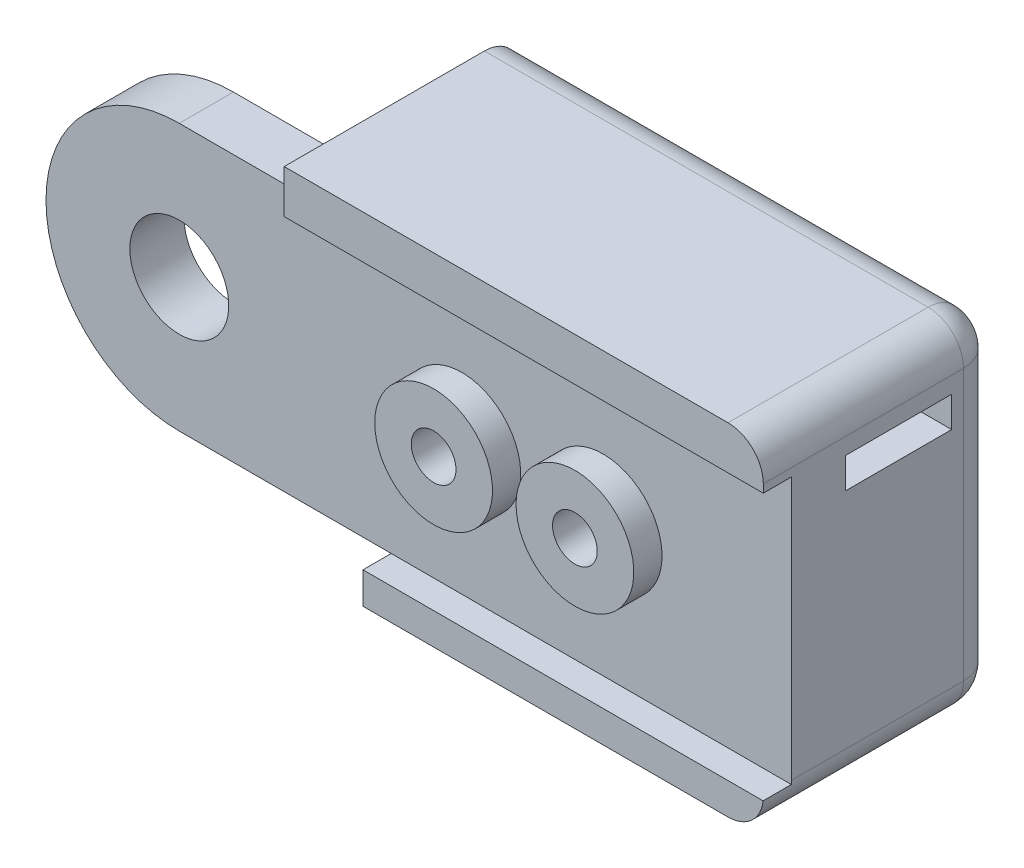
ISO-10303-21;
HEADER;
FILE_DESCRIPTION(('STEP AP214'),'2;1');
FILE_NAME('part.step','',(''),(''),'','','');
FILE_SCHEMA(('AUTOMOTIVE_DESIGN { 1 0 10303 214 1 1 1 1 }'));
ENDSEC;
DATA;
#1=APPLICATION_CONTEXT('core data for automotive mechanical design processes');
#2=APPLICATION_PROTOCOL_DEFINITION('international standard','automotive_design',2000,#1);
#3=PRODUCT_CONTEXT('',#1,'mechanical');
#4=PRODUCT('Part','Part','',(#3));
#5=PRODUCT_RELATED_PRODUCT_CATEGORY('part','',(#4));
#6=PRODUCT_DEFINITION_FORMATION('','',#4);
#7=PRODUCT_DEFINITION_CONTEXT('part definition',#1,'design');
#8=PRODUCT_DEFINITION('design','',#6,#7);
#9=PRODUCT_DEFINITION_SHAPE('','',#8);
#10=(LENGTH_UNIT() NAMED_UNIT(*) SI_UNIT(.MILLI.,.METRE.));
#11=(NAMED_UNIT(*) PLANE_ANGLE_UNIT() SI_UNIT($,.RADIAN.));
#12=(NAMED_UNIT(*) SI_UNIT($,.STERADIAN.) SOLID_ANGLE_UNIT());
#13=UNCERTAINTY_MEASURE_WITH_UNIT(LENGTH_MEASURE(1.E-05),#10,'distance_accuracy_value','');
#14=(GEOMETRIC_REPRESENTATION_CONTEXT(3) GLOBAL_UNCERTAINTY_ASSIGNED_CONTEXT((#13)) GLOBAL_UNIT_ASSIGNED_CONTEXT((#10,
#11,#12)) REPRESENTATION_CONTEXT('',''));
#15=CARTESIAN_POINT('',(0.,0.,0.));
#16=DIRECTION('',(0.,0.,1.));
#17=DIRECTION('',(1.,0.,0.));
#18=AXIS2_PLACEMENT_3D('',#15,#16,#17);
#19=CARTESIAN_POINT('',(0.,0.,-8.));
#20=DIRECTION('',(0.,0.,-1.));
#21=DIRECTION('',(-1.,0.,0.));
#22=AXIS2_PLACEMENT_3D('',#19,#20,#21);
#23=PLANE('',#22);
#24=CARTESIAN_POINT('',(12.,0.,-8.));
#25=DIRECTION('',(0.,0.,-1.));
#26=DIRECTION('',(-1.,0.,0.));
#27=AXIS2_PLACEMENT_3D('',#24,#25,#26);
#28=CIRCLE('',#27,2.5);
#29=CARTESIAN_POINT('',(9.50000000000001,0.,-8.));
#30=VERTEX_POINT('',#29);
#31=EDGE_CURVE('E442',#30,#30,#28,.T.);
#32=ORIENTED_EDGE('',*,*,#31,.F.);
#33=EDGE_LOOP('',(#32));
#34=FACE_BOUND('',#33,.T.);
#35=CARTESIAN_POINT('',(12.,0.,-8.));
#36=DIRECTION('',(0.,0.,-1.));
#37=DIRECTION('',(-1.,0.,0.));
#38=AXIS2_PLACEMENT_3D('',#35,#36,#37);
#39=CIRCLE('',#38,0.949999999999999);
#40=CARTESIAN_POINT('',(11.05,0.,-8.));
#41=VERTEX_POINT('',#40);
#42=EDGE_CURVE('E454',#41,#41,#39,.F.);
#43=ORIENTED_EDGE('',*,*,#42,.F.);
#44=EDGE_LOOP('',(#43));
#45=FACE_BOUND('',#44,.T.);
#46=ADVANCED_FACE('F42',(#34,#45),#23,.F.);
#47=CARTESIAN_POINT('',(18.,0.,-8.));
#48=DIRECTION('',(0.,0.,-1.));
#49=DIRECTION('',(-1.,0.,0.));
#50=AXIS2_PLACEMENT_3D('',#47,#48,#49);
#51=CIRCLE('',#50,2.5);
#52=CARTESIAN_POINT('',(15.5,0.,-8.));
#53=VERTEX_POINT('',#52);
#54=EDGE_CURVE('E439',#53,#53,#51,.T.);
#55=ORIENTED_EDGE('',*,*,#54,.F.);
#56=EDGE_LOOP('',(#55));
#57=FACE_BOUND('',#56,.T.);
#58=CARTESIAN_POINT('',(18.,0.,-8.));
#59=DIRECTION('',(0.,0.,-1.));
#60=DIRECTION('',(-1.,0.,0.));
#61=AXIS2_PLACEMENT_3D('',#58,#59,#60);
#62=CIRCLE('',#61,0.950000000000001);
#63=CARTESIAN_POINT('',(17.05,0.,-8.));
#64=VERTEX_POINT('',#63);
#65=EDGE_CURVE('E46',#64,#64,#62,.F.);
#66=ORIENTED_EDGE('',*,*,#65,.F.);
#67=EDGE_LOOP('',(#66));
#68=FACE_BOUND('',#67,.T.);
#69=ADVANCED_FACE('F44',(#57,#68),#23,.F.);
#70=DIRECTION('',(-1.,0.,0.));
#71=VECTOR('',#70,1.);
#72=CARTESIAN_POINT('',(26.,-7.00163526528755,-8.));
#73=LINE('',#72,#71);
#74=CARTESIAN_POINT('',(24.5,-7.00163526528755,-8.));
#75=VERTEX_POINT('',#74);
#76=CARTESIAN_POINT('',(9.00000000000001,-7.00163526528755,-8.));
#77=VERTEX_POINT('',#76);
#78=EDGE_CURVE('E435',#75,#77,#73,.T.);
#79=ORIENTED_EDGE('',*,*,#78,.F.);
#80=CARTESIAN_POINT('',(24.5,-5.50163526528755,-8.));
#81=DIRECTION('',(0.,0.,-1.));
#82=DIRECTION('',(-1.,0.,0.));
#83=AXIS2_PLACEMENT_3D('',#80,#81,#82);
#84=CIRCLE('',#83,1.5);
#85=CARTESIAN_POINT('',(25.9916169632113,-5.65999825042065,-8.));
#86=VERTEX_POINT('',#85);
#87=EDGE_CURVE('E52',#75,#86,#84,.F.);
#88=ORIENTED_EDGE('',*,*,#87,.T.);
#89=DIRECTION('',(1.,0.,0.));
#90=VECTOR('',#89,1.);
#91=CARTESIAN_POINT('',(9.00000000000001,-5.65999825042065,-8.));
#92=LINE('',#91,#90);
#93=CARTESIAN_POINT('',(9.00000000000001,-5.65999825042065,-8.));
#94=VERTEX_POINT('',#93);
#95=EDGE_CURVE('E428',#94,#86,#92,.T.);
#96=ORIENTED_EDGE('',*,*,#95,.F.);
#97=DIRECTION('',(0.,1.,0.));
#98=VECTOR('',#97,1.);
#99=CARTESIAN_POINT('',(9.00000000000001,-7.00163526528755,-8.));
#100=LINE('',#99,#98);
#101=EDGE_CURVE('E451',#77,#94,#100,.T.);
#102=ORIENTED_EDGE('',*,*,#101,.F.);
#103=EDGE_LOOP('',(#79,#88,#96,#102));
#104=FACE_BOUND('',#103,.T.);
#105=ADVANCED_FACE('F472',(#104),#23,.F.);
#106=DIRECTION('',(-1.,0.,0.));
#107=VECTOR('',#106,1.);
#108=CARTESIAN_POINT('',(26.,5.65685424949239,-8.));
#109=LINE('',#108,#107);
#110=CARTESIAN_POINT('',(26.,5.65685424949239,-8.));
#111=VERTEX_POINT('',#110);
#112=CARTESIAN_POINT('',(5.65685424949238,5.65685424949239,-8.));
#113=VERTEX_POINT('',#112);
#114=EDGE_CURVE('E436',#111,#113,#109,.T.);
#115=ORIENTED_EDGE('',*,*,#114,.F.);
#116=DIRECTION('',(0.,-1.,0.));
#117=VECTOR('',#116,1.);
#118=CARTESIAN_POINT('',(26.,-7.00163526528755,-8.));
#119=LINE('',#118,#117);
#120=CARTESIAN_POINT('',(26.,5.99836473471239,-8.));
#121=VERTEX_POINT('',#120);
#122=EDGE_CURVE('E198',#121,#111,#119,.T.);
#123=ORIENTED_EDGE('',*,*,#122,.F.);
#124=CARTESIAN_POINT('',(24.5,5.99836473471239,-8.));
#125=DIRECTION('',(0.,0.,-1.));
#126=DIRECTION('',(-1.,0.,0.));
#127=AXIS2_PLACEMENT_3D('',#124,#125,#126);
#128=CIRCLE('',#127,1.5);
#129=CARTESIAN_POINT('',(24.5,7.49836473471239,-8.));
#130=VERTEX_POINT('',#129);
#131=EDGE_CURVE('E12',#121,#130,#128,.F.);
#132=ORIENTED_EDGE('',*,*,#131,.T.);
#133=DIRECTION('',(1.,0.,0.));
#134=VECTOR('',#133,1.);
#135=CARTESIAN_POINT('',(5.65685424949238,7.49836473471238,-8.));
#136=LINE('',#135,#134);
#137=CARTESIAN_POINT('',(5.65685424949238,7.49836473471238,-8.));
#138=VERTEX_POINT('',#137);
#139=EDGE_CURVE('E66',#138,#130,#136,.T.);
#140=ORIENTED_EDGE('',*,*,#139,.F.);
#141=DIRECTION('',(0.,1.,0.));
#142=VECTOR('',#141,1.);
#143=CARTESIAN_POINT('',(5.65685424949238,5.65685424949239,-8.));
#144=LINE('',#143,#142);
#145=EDGE_CURVE('E432',#113,#138,#144,.T.);
#146=ORIENTED_EDGE('',*,*,#145,.F.);
#147=EDGE_LOOP('',(#115,#123,#132,#140,#146));
#148=FACE_BOUND('',#147,.T.);
#149=ADVANCED_FACE('F474',(#148),#23,.F.);
#150=CARTESIAN_POINT('',(18.,0.,1.2));
#151=DIRECTION('',(0.,0.,-1.));
#152=DIRECTION('',(-1.,0.,0.));
#153=AXIS2_PLACEMENT_3D('',#150,#151,#152);
#154=CYLINDRICAL_SURFACE('',#153,0.950000000000001);
#155=ORIENTED_EDGE('',*,*,#65,.T.);
#156=EDGE_LOOP('',(#155));
#157=FACE_BOUND('',#156,.T.);
#158=CARTESIAN_POINT('',(18.,0.,-13.5));
#159=DIRECTION('',(0.,0.,1.));
#160=DIRECTION('',(1.,0.,0.));
#161=AXIS2_PLACEMENT_3D('',#158,#159,#160);
#162=CIRCLE('',#161,0.950000000000001);
#163=CARTESIAN_POINT('',(18.95,0.,-13.5));
#164=VERTEX_POINT('',#163);
#165=EDGE_CURVE('E341',#164,#164,#162,.F.);
#166=ORIENTED_EDGE('',*,*,#165,.T.);
#167=EDGE_LOOP('',(#166));
#168=FACE_BOUND('',#167,.T.);
#169=ADVANCED_FACE('F468',(#157,#168),#154,.F.);
#170=CARTESIAN_POINT('',(12.,0.,1.2));
#171=DIRECTION('',(0.,0.,-1.));
#172=DIRECTION('',(-1.,0.,0.));
#173=AXIS2_PLACEMENT_3D('',#170,#171,#172);
#174=CYLINDRICAL_SURFACE('',#173,0.949999999999999);
#175=ORIENTED_EDGE('',*,*,#42,.T.);
#176=EDGE_LOOP('',(#175));
#177=FACE_BOUND('',#176,.T.);
#178=CARTESIAN_POINT('',(12.,0.,-13.5));
#179=DIRECTION('',(0.,0.,1.));
#180=DIRECTION('',(1.,0.,0.));
#181=AXIS2_PLACEMENT_3D('',#178,#179,#180);
#182=CIRCLE('',#181,0.949999999999999);
#183=CARTESIAN_POINT('',(12.95,0.,-13.5));
#184=VERTEX_POINT('',#183);
#185=EDGE_CURVE('E337',#184,#184,#182,.F.);
#186=ORIENTED_EDGE('',*,*,#185,.T.);
#187=EDGE_LOOP('',(#186));
#188=FACE_BOUND('',#187,.T.);
#189=ADVANCED_FACE('F488',(#177,#188),#174,.F.);
#190=CARTESIAN_POINT('',(9.00000000000001,-7.00163526528755,2.));
#191=DIRECTION('',(1.,0.,0.));
#192=DIRECTION('',(0.,0.,-1.));
#193=AXIS2_PLACEMENT_3D('',#190,#191,#192);
#194=PLANE('',#193);
#195=DIRECTION('',(0.,0.,-1.));
#196=VECTOR('',#195,1.);
#197=CARTESIAN_POINT('',(9.00000000000001,-7.00163526528755,2.));
#198=LINE('',#197,#196);
#199=CARTESIAN_POINT('',(9.00000000000001,-7.00163526528755,-16.5));
#200=VERTEX_POINT('',#199);
#201=EDGE_CURVE('E413',#77,#200,#198,.T.);
#202=ORIENTED_EDGE('',*,*,#201,.F.);
#203=ORIENTED_EDGE('',*,*,#101,.T.);
#204=DIRECTION('',(0.,0.,1.));
#205=VECTOR('',#204,1.);
#206=CARTESIAN_POINT('',(9.00000000000001,-5.65999825042065,-8.));
#207=LINE('',#206,#205);
#208=CARTESIAN_POINT('',(9.00000000000001,-5.65999825042065,-9.2));
#209=VERTEX_POINT('',#208);
#210=EDGE_CURVE('E204',#209,#94,#207,.T.);
#211=ORIENTED_EDGE('',*,*,#210,.F.);
#212=DIRECTION('',(0.,0.,-1.));
#213=VECTOR('',#212,1.);
#214=CARTESIAN_POINT('',(9.00000000000001,-5.65999825042065,-9.2));
#215=LINE('',#214,#213);
#216=CARTESIAN_POINT('',(9.00000000000001,-5.65999825042065,-11.5));
#217=VERTEX_POINT('',#216);
#218=EDGE_CURVE('E223',#209,#217,#215,.T.);
#219=ORIENTED_EDGE('',*,*,#218,.T.);
#220=DIRECTION('',(0.,1.,0.));
#221=VECTOR('',#220,1.);
#222=CARTESIAN_POINT('',(9.00000000000001,-7.00163526528755,-11.5));
#223=LINE('',#222,#221);
#224=CARTESIAN_POINT('',(9.00000000000001,-2.50163526528762,-11.5));
#225=VERTEX_POINT('',#224);
#226=EDGE_CURVE('E262',#217,#225,#223,.T.);
#227=ORIENTED_EDGE('',*,*,#226,.T.);
#228=DIRECTION('',(0.,0.,1.));
#229=VECTOR('',#228,1.);
#230=CARTESIAN_POINT('',(9.00000000000001,-2.50163526528762,-18.));
#231=LINE('',#230,#229);
#232=CARTESIAN_POINT('',(9.00000000000001,-2.50163526528762,-18.));
#233=VERTEX_POINT('',#232);
#234=EDGE_CURVE('E318',#233,#225,#231,.T.);
#235=ORIENTED_EDGE('',*,*,#234,.F.);
#236=DIRECTION('',(0.,-1.,0.));
#237=VECTOR('',#236,1.);
#238=CARTESIAN_POINT('',(9.00000000000001,-7.00163526528755,-18.));
#239=LINE('',#238,#237);
#240=CARTESIAN_POINT('',(9.00000000000001,-5.50163526528755,-18.));
#241=VERTEX_POINT('',#240);
#242=EDGE_CURVE('E307',#233,#241,#239,.T.);
#243=ORIENTED_EDGE('',*,*,#242,.T.);
#244=CARTESIAN_POINT('',(9.00000000000001,-5.50163526528755,-16.5));
#245=DIRECTION('',(-1.,0.,0.));
#246=DIRECTION('',(0.,0.,1.));
#247=AXIS2_PLACEMENT_3D('',#244,#245,#246);
#248=CIRCLE('',#247,1.5);
#249=EDGE_CURVE('E370',#200,#241,#248,.F.);
#250=ORIENTED_EDGE('',*,*,#249,.F.);
#251=EDGE_LOOP('',(#202,#203,#211,#219,#227,#235,#243,#250));
#252=FACE_BOUND('',#251,.T.);
#253=ADVANCED_FACE('F603',(#252),#194,.F.);
#254=CARTESIAN_POINT('',(26.,-7.00163526528755,2.));
#255=DIRECTION('',(0.,1.,0.));
#256=DIRECTION('',(-1.,0.,0.));
#257=AXIS2_PLACEMENT_3D('',#254,#255,#256);
#258=PLANE('',#257);
#259=DIRECTION('',(0.,0.,-1.));
#260=VECTOR('',#259,1.);
#261=CARTESIAN_POINT('',(24.5,-7.00163526528755,2.));
#262=LINE('',#261,#260);
#263=CARTESIAN_POINT('',(24.5,-7.00163526528755,-16.5));
#264=VERTEX_POINT('',#263);
#265=EDGE_CURVE('E422',#264,#75,#262,.F.);
#266=ORIENTED_EDGE('',*,*,#265,.T.);
#267=ORIENTED_EDGE('',*,*,#78,.T.);
#268=ORIENTED_EDGE('',*,*,#201,.T.);
#269=DIRECTION('',(1.,0.,0.));
#270=VECTOR('',#269,1.);
#271=CARTESIAN_POINT('',(9.00000000000001,-7.00163526528755,-16.5));
#272=LINE('',#271,#270);
#273=EDGE_CURVE('E366',#264,#200,#272,.F.);
#274=ORIENTED_EDGE('',*,*,#273,.F.);
#275=EDGE_LOOP('',(#266,#267,#268,#274));
#276=FACE_BOUND('',#275,.T.);
#277=CARTESIAN_POINT('',(22.,-7.00163526528755,-15.));
#278=DIRECTION('',(0.,1.,0.));
#279=DIRECTION('',(1.,0.,0.));
#280=AXIS2_PLACEMENT_3D('',#277,#278,#279);
#281=CIRCLE('',#280,0.950000000000001);
#282=CARTESIAN_POINT('',(22.95,-7.00163526528755,-15.));
#283=VERTEX_POINT('',#282);
#284=EDGE_CURVE('E703',#283,#283,#281,.T.);
#285=ORIENTED_EDGE('',*,*,#284,.T.);
#286=EDGE_LOOP('',(#285));
#287=FACE_BOUND('',#286,.T.);
#288=CARTESIAN_POINT('',(18.,-7.00163526528755,-15.));
#289=DIRECTION('',(0.,1.,0.));
#290=DIRECTION('',(1.,0.,0.));
#291=AXIS2_PLACEMENT_3D('',#288,#289,#290);
#292=CIRCLE('',#291,0.950000000000001);
#293=CARTESIAN_POINT('',(18.95,-7.00163526528755,-15.));
#294=VERTEX_POINT('',#293);
#295=EDGE_CURVE('E695',#294,#294,#292,.T.);
#296=ORIENTED_EDGE('',*,*,#295,.T.);
#297=EDGE_LOOP('',(#296));
#298=FACE_BOUND('',#297,.T.);
#299=ADVANCED_FACE('F620',(#276,#287,#298),#258,.F.);
#300=CARTESIAN_POINT('',(26.,-7.00163526528755,2.));
#301=DIRECTION('',(-1.,0.,0.));
#302=DIRECTION('',(0.,0.,1.));
#303=AXIS2_PLACEMENT_3D('',#300,#301,#302);
#304=PLANE('',#303);
#305=DIRECTION('',(0.,0.,-1.));
#306=VECTOR('',#305,1.);
#307=CARTESIAN_POINT('',(26.,5.99836473471239,2.));
#308=LINE('',#307,#306);
#309=CARTESIAN_POINT('',(26.,5.99836473471239,-16.5));
#310=VERTEX_POINT('',#309);
#311=EDGE_CURVE('E416',#310,#121,#308,.F.);
#312=ORIENTED_EDGE('',*,*,#311,.T.);
#313=ORIENTED_EDGE('',*,*,#122,.T.);
#314=DIRECTION('',(0.,0.,1.));
#315=VECTOR('',#314,1.);
#316=CARTESIAN_POINT('',(26.,5.65685424949239,-8.));
#317=LINE('',#316,#315);
#318=CARTESIAN_POINT('',(26.,5.65685424949239,-9.2));
#319=VERTEX_POINT('',#318);
#320=EDGE_CURVE('E190',#319,#111,#317,.T.);
#321=ORIENTED_EDGE('',*,*,#320,.F.);
#322=DIRECTION('',(0.,-1.,0.));
#323=VECTOR('',#322,1.);
#324=CARTESIAN_POINT('',(26.,0.,-9.2));
#325=LINE('',#324,#323);
#326=CARTESIAN_POINT('',(26.,-5.50163526528755,-9.2));
#327=VERTEX_POINT('',#326);
#328=EDGE_CURVE('E197',#319,#327,#325,.T.);
#329=ORIENTED_EDGE('',*,*,#328,.T.);
#330=DIRECTION('',(0.,0.,1.));
#331=VECTOR('',#330,1.);
#332=CARTESIAN_POINT('',(26.,-5.50163526528755,-18.));
#333=LINE('',#332,#331);
#334=CARTESIAN_POINT('',(26.,-5.50163526528755,-16.5));
#335=VERTEX_POINT('',#334);
#336=EDGE_CURVE('E361',#335,#327,#333,.T.);
#337=ORIENTED_EDGE('',*,*,#336,.F.);
#338=DIRECTION('',(0.,1.,0.));
#339=VECTOR('',#338,1.);
#340=CARTESIAN_POINT('',(26.,-7.00163526528755,-16.5));
#341=LINE('',#340,#339);
#342=EDGE_CURVE('E357',#310,#335,#341,.F.);
#343=ORIENTED_EDGE('',*,*,#342,.F.);
#344=EDGE_LOOP('',(#312,#313,#321,#329,#337,#343));
#345=FACE_BOUND('',#344,.T.);
#346=DIRECTION('',(0.,0.,1.));
#347=VECTOR('',#346,1.);
#348=CARTESIAN_POINT('',(26.,5.29836473471238,-18.));
#349=LINE('',#348,#347);
#350=CARTESIAN_POINT('',(26.,5.29836473471238,-16.));
#351=VERTEX_POINT('',#350);
#352=CARTESIAN_POINT('',(26.,5.29836473471238,-11.5));
#353=VERTEX_POINT('',#352);
#354=EDGE_CURVE('E279',#351,#353,#349,.T.);
#355=ORIENTED_EDGE('',*,*,#354,.F.);
#356=DIRECTION('',(0.,1.,0.));
#357=VECTOR('',#356,1.);
#358=CARTESIAN_POINT('',(26.,-7.00163526528755,-16.));
#359=LINE('',#358,#357);
#360=CARTESIAN_POINT('',(26.,3.99836473471238,-16.));
#361=VERTEX_POINT('',#360);
#362=EDGE_CURVE('E332',#361,#351,#359,.T.);
#363=ORIENTED_EDGE('',*,*,#362,.F.);
#364=DIRECTION('',(0.,0.,-1.));
#365=VECTOR('',#364,1.);
#366=CARTESIAN_POINT('',(26.,3.99836473471238,-18.));
#367=LINE('',#366,#365);
#368=CARTESIAN_POINT('',(26.,3.99836473471238,-11.5));
#369=VERTEX_POINT('',#368);
#370=EDGE_CURVE('E271',#369,#361,#367,.T.);
#371=ORIENTED_EDGE('',*,*,#370,.F.);
#372=DIRECTION('',(0.,-1.,0.));
#373=VECTOR('',#372,1.);
#374=CARTESIAN_POINT('',(26.,0.,-11.5));
#375=LINE('',#374,#373);
#376=EDGE_CURVE('E248',#353,#369,#375,.T.);
#377=ORIENTED_EDGE('',*,*,#376,.F.);
#378=EDGE_LOOP('',(#355,#363,#371,#377));
#379=FACE_BOUND('',#378,.T.);
#380=ADVANCED_FACE('F193',(#345,#379),#304,.F.);
#381=CARTESIAN_POINT('',(5.65685424949238,7.49836473471238,2.));
#382=DIRECTION('',(0.,-1.,0.));
#383=DIRECTION('',(1.,0.,0.));
#384=AXIS2_PLACEMENT_3D('',#381,#382,#383);
#385=PLANE('',#384);
#386=DIRECTION('',(0.,0.,-1.));
#387=VECTOR('',#386,1.);
#388=CARTESIAN_POINT('',(5.65685424949238,7.49836473471238,2.));
#389=LINE('',#388,#387);
#390=CARTESIAN_POINT('',(5.65685424949238,7.49836473471238,-16.5));
#391=VERTEX_POINT('',#390);
#392=EDGE_CURVE('E410',#138,#391,#389,.T.);
#393=ORIENTED_EDGE('',*,*,#392,.F.);
#394=ORIENTED_EDGE('',*,*,#139,.T.);
#395=DIRECTION('',(0.,0.,-1.));
#396=VECTOR('',#395,1.);
#397=CARTESIAN_POINT('',(24.5,7.49836473471239,2.));
#398=LINE('',#397,#396);
#399=CARTESIAN_POINT('',(24.5,7.49836473471239,-16.5));
#400=VERTEX_POINT('',#399);
#401=EDGE_CURVE('E426',#130,#400,#398,.T.);
#402=ORIENTED_EDGE('',*,*,#401,.T.);
#403=DIRECTION('',(-1.,0.,0.));
#404=VECTOR('',#403,1.);
#405=CARTESIAN_POINT('',(26.,7.49836473471239,-16.5));
#406=LINE('',#405,#404);
#407=EDGE_CURVE('E378',#391,#400,#406,.F.);
#408=ORIENTED_EDGE('',*,*,#407,.F.);
#409=EDGE_LOOP('',(#393,#394,#402,#408));
#410=FACE_BOUND('',#409,.T.);
#411=ADVANCED_FACE('F614',(#410),#385,.F.);
#412=CARTESIAN_POINT('',(5.65685424949238,5.65685424949239,2.));
#413=DIRECTION('',(1.,0.,0.));
#414=DIRECTION('',(0.,0.,-1.));
#415=AXIS2_PLACEMENT_3D('',#412,#413,#414);
#416=PLANE('',#415);
#417=DIRECTION('',(0.,0.,1.));
#418=VECTOR('',#417,1.);
#419=CARTESIAN_POINT('',(5.65685424949238,5.65685424949239,-8.));
#420=LINE('',#419,#418);
#421=CARTESIAN_POINT('',(5.65685424949238,5.65685424949239,-9.2));
#422=VERTEX_POINT('',#421);
#423=EDGE_CURVE('E203',#422,#113,#420,.T.);
#424=ORIENTED_EDGE('',*,*,#423,.T.);
#425=ORIENTED_EDGE('',*,*,#145,.T.);
#426=ORIENTED_EDGE('',*,*,#392,.T.);
#427=CARTESIAN_POINT('',(5.65685424949238,5.99836473471239,-16.5));
#428=DIRECTION('',(-1.,0.,0.));
#429=DIRECTION('',(0.,0.,1.));
#430=AXIS2_PLACEMENT_3D('',#427,#428,#429);
#431=CIRCLE('',#430,1.5);
#432=CARTESIAN_POINT('',(5.65685424949238,5.99836473471239,-18.));
#433=VERTEX_POINT('',#432);
#434=EDGE_CURVE('E374',#433,#391,#431,.F.);
#435=ORIENTED_EDGE('',*,*,#434,.F.);
#436=DIRECTION('',(0.,-1.,0.));
#437=VECTOR('',#436,1.);
#438=CARTESIAN_POINT('',(5.65685424949238,5.65685424949239,-18.));
#439=LINE('',#438,#437);
#440=CARTESIAN_POINT('',(5.65685424949238,5.65685424949239,-18.));
#441=VERTEX_POINT('',#440);
#442=EDGE_CURVE('E311',#433,#441,#439,.T.);
#443=ORIENTED_EDGE('',*,*,#442,.T.);
#444=DIRECTION('',(0.,0.,1.));
#445=VECTOR('',#444,1.);
#446=CARTESIAN_POINT('',(5.65685424949238,5.65685424949239,-18.));
#447=LINE('',#446,#445);
#448=CARTESIAN_POINT('',(5.65685424949238,5.65685424949239,-11.5));
#449=VERTEX_POINT('',#448);
#450=EDGE_CURVE('E314',#441,#449,#447,.T.);
#451=ORIENTED_EDGE('',*,*,#450,.T.);
#452=DIRECTION('',(0.,0.,-1.));
#453=VECTOR('',#452,1.);
#454=CARTESIAN_POINT('',(5.65685424949238,5.65685424949239,-9.2));
#455=LINE('',#454,#453);
#456=EDGE_CURVE('E229',#422,#449,#455,.T.);
#457=ORIENTED_EDGE('',*,*,#456,.F.);
#458=EDGE_LOOP('',(#424,#425,#426,#435,#443,#451,#457));
#459=FACE_BOUND('',#458,.T.);
#460=ADVANCED_FACE('F610',(#459),#416,.F.);
#461=CARTESIAN_POINT('',(12.,0.,-8.));
#462=DIRECTION('',(0.,0.,1.));
#463=DIRECTION('',(1.,0.,0.));
#464=AXIS2_PLACEMENT_3D('',#461,#462,#463);
#465=CYLINDRICAL_SURFACE('',#464,2.5);
#466=ORIENTED_EDGE('',*,*,#31,.T.);
#467=EDGE_LOOP('',(#466));
#468=FACE_BOUND('',#467,.T.);
#469=CARTESIAN_POINT('',(12.,0.,-9.2));
#470=DIRECTION('',(0.,0.,-1.));
#471=DIRECTION('',(-1.,0.,0.));
#472=AXIS2_PLACEMENT_3D('',#469,#470,#471);
#473=CIRCLE('',#472,2.5);
#474=CARTESIAN_POINT('',(9.50000000000001,0.,-9.2));
#475=VERTEX_POINT('',#474);
#476=EDGE_CURVE('E672',#475,#475,#473,.T.);
#477=ORIENTED_EDGE('',*,*,#476,.F.);
#478=EDGE_LOOP('',(#477));
#479=FACE_BOUND('',#478,.T.);
#480=ADVANCED_FACE('F606',(#468,#479),#465,.T.);
#481=CARTESIAN_POINT('',(18.,0.,-8.));
#482=DIRECTION('',(0.,0.,1.));
#483=DIRECTION('',(1.,0.,0.));
#484=AXIS2_PLACEMENT_3D('',#481,#482,#483);
#485=CYLINDRICAL_SURFACE('',#484,2.5);
#486=ORIENTED_EDGE('',*,*,#54,.T.);
#487=EDGE_LOOP('',(#486));
#488=FACE_BOUND('',#487,.T.);
#489=CARTESIAN_POINT('',(18.,0.,-9.2));
#490=DIRECTION('',(0.,0.,-1.));
#491=DIRECTION('',(-1.,0.,0.));
#492=AXIS2_PLACEMENT_3D('',#489,#490,#491);
#493=CIRCLE('',#492,2.5);
#494=CARTESIAN_POINT('',(15.5,0.,-9.2));
#495=VERTEX_POINT('',#494);
#496=EDGE_CURVE('E346',#495,#495,#493,.T.);
#497=ORIENTED_EDGE('',*,*,#496,.F.);
#498=EDGE_LOOP('',(#497));
#499=FACE_BOUND('',#498,.T.);
#500=ADVANCED_FACE('F599',(#488,#499),#485,.T.);
#501=CARTESIAN_POINT('',(26.,5.65685424949239,-8.));
#502=DIRECTION('',(0.,1.,0.));
#503=DIRECTION('',(-1.,0.,0.));
#504=AXIS2_PLACEMENT_3D('',#501,#502,#503);
#505=PLANE('',#504);
#506=ORIENTED_EDGE('',*,*,#320,.T.);
#507=ORIENTED_EDGE('',*,*,#114,.T.);
#508=ORIENTED_EDGE('',*,*,#423,.F.);
#509=DIRECTION('',(-1.,0.,0.));
#510=VECTOR('',#509,1.);
#511=CARTESIAN_POINT('',(26.,5.65685424949239,-9.2));
#512=LINE('',#511,#510);
#513=EDGE_CURVE('E207',#319,#422,#512,.T.);
#514=ORIENTED_EDGE('',*,*,#513,.F.);
#515=EDGE_LOOP('',(#506,#507,#508,#514));
#516=FACE_BOUND('',#515,.T.);
#517=ADVANCED_FACE('F208',(#516),#505,.F.);
#518=CARTESIAN_POINT('',(9.00000000000001,-5.65999825042065,-8.));
#519=DIRECTION('',(0.,-1.,0.));
#520=DIRECTION('',(1.,0.,0.));
#521=AXIS2_PLACEMENT_3D('',#518,#519,#520);
#522=PLANE('',#521);
#523=ORIENTED_EDGE('',*,*,#210,.T.);
#524=ORIENTED_EDGE('',*,*,#95,.T.);
#525=DIRECTION('',(0.,0.,-1.));
#526=VECTOR('',#525,1.);
#527=CARTESIAN_POINT('',(25.9916169632113,-5.65999825042065,-6.8));
#528=LINE('',#527,#526);
#529=CARTESIAN_POINT('',(25.9916169632113,-5.65999825042065,-9.2));
#530=VERTEX_POINT('',#529);
#531=EDGE_CURVE('E419',#86,#530,#528,.T.);
#532=ORIENTED_EDGE('',*,*,#531,.T.);
#533=DIRECTION('',(1.,0.,0.));
#534=VECTOR('',#533,1.);
#535=CARTESIAN_POINT('',(9.00000000000001,-5.65999825042065,-9.2));
#536=LINE('',#535,#534);
#537=EDGE_CURVE('E215',#209,#530,#536,.T.);
#538=ORIENTED_EDGE('',*,*,#537,.F.);
#539=EDGE_LOOP('',(#523,#524,#532,#538));
#540=FACE_BOUND('',#539,.T.);
#541=ADVANCED_FACE('F593',(#540),#522,.F.);
#542=CARTESIAN_POINT('',(24.5,-5.50163526528755,2.));
#543=DIRECTION('',(0.,0.,-1.));
#544=DIRECTION('',(-1.,0.,0.));
#545=AXIS2_PLACEMENT_3D('',#542,#543,#544);
#546=CYLINDRICAL_SURFACE('',#545,1.5);
#547=ORIENTED_EDGE('',*,*,#87,.F.);
#548=ORIENTED_EDGE('',*,*,#265,.F.);
#549=CARTESIAN_POINT('',(24.5,-5.50163526528755,-16.5));
#550=DIRECTION('',(0.,0.,1.));
#551=DIRECTION('',(1.,0.,0.));
#552=AXIS2_PLACEMENT_3D('',#549,#550,#551);
#553=CIRCLE('',#552,1.5);
#554=EDGE_CURVE('E401',#264,#335,#553,.T.);
#555=ORIENTED_EDGE('',*,*,#554,.T.);
#556=ORIENTED_EDGE('',*,*,#336,.T.);
#557=CARTESIAN_POINT('',(24.5,-5.50163526528755,-9.2));
#558=DIRECTION('',(0.,0.,-1.));
#559=DIRECTION('',(-1.,0.,0.));
#560=AXIS2_PLACEMENT_3D('',#557,#558,#559);
#561=CIRCLE('',#560,1.5);
#562=EDGE_CURVE('E221',#327,#530,#561,.T.);
#563=ORIENTED_EDGE('',*,*,#562,.T.);
#564=ORIENTED_EDGE('',*,*,#531,.F.);
#565=EDGE_LOOP('',(#547,#548,#555,#556,#563,#564));
#566=FACE_BOUND('',#565,.T.);
#567=ADVANCED_FACE('F596',(#566),#546,.T.);
#568=CARTESIAN_POINT('',(24.5,5.99836473471239,2.));
#569=DIRECTION('',(0.,0.,-1.));
#570=DIRECTION('',(-1.,0.,0.));
#571=AXIS2_PLACEMENT_3D('',#568,#569,#570);
#572=CYLINDRICAL_SURFACE('',#571,1.5);
#573=ORIENTED_EDGE('',*,*,#131,.F.);
#574=ORIENTED_EDGE('',*,*,#311,.F.);
#575=CARTESIAN_POINT('',(24.5,5.99836473471239,-16.5));
#576=DIRECTION('',(0.,0.,1.));
#577=DIRECTION('',(1.,0.,0.));
#578=AXIS2_PLACEMENT_3D('',#575,#576,#577);
#579=CIRCLE('',#578,1.5);
#580=EDGE_CURVE('E389',#310,#400,#579,.T.);
#581=ORIENTED_EDGE('',*,*,#580,.T.);
#582=ORIENTED_EDGE('',*,*,#401,.F.);
#583=EDGE_LOOP('',(#573,#574,#581,#582));
#584=FACE_BOUND('',#583,.T.);
#585=ADVANCED_FACE('F535',(#584),#572,.T.);
#586=CARTESIAN_POINT('',(0.,0.,-9.2));
#587=DIRECTION('',(0.,0.,1.));
#588=DIRECTION('',(-1.,0.,0.));
#589=AXIS2_PLACEMENT_3D('',#586,#587,#588);
#590=PLANE('',#589);
#591=ORIENTED_EDGE('',*,*,#496,.T.);
#592=EDGE_LOOP('',(#591));
#593=FACE_BOUND('',#592,.T.);
#594=ORIENTED_EDGE('',*,*,#476,.T.);
#595=EDGE_LOOP('',(#594));
#596=FACE_BOUND('',#595,.T.);
#597=CARTESIAN_POINT('',(0.,0.,-9.2));
#598=DIRECTION('',(0.,0.,-1.));
#599=DIRECTION('',(-1.,0.,0.));
#600=AXIS2_PLACEMENT_3D('',#597,#598,#599);
#601=CIRCLE('',#600,2.1);
#602=CARTESIAN_POINT('',(-2.1,0.,-9.2));
#603=VERTEX_POINT('',#602);
#604=EDGE_CURVE('E668',#603,#603,#601,.T.);
#605=ORIENTED_EDGE('',*,*,#604,.T.);
#606=EDGE_LOOP('',(#605));
#607=FACE_BOUND('',#606,.T.);
#608=ORIENTED_EDGE('',*,*,#328,.F.);
#609=ORIENTED_EDGE('',*,*,#513,.T.);
#610=DIRECTION('',(0.999999845550945,-0.000555786008266288,0.));
#611=VECTOR('',#610,1.);
#612=CARTESIAN_POINT('',(0.00314574734853769,5.65999650205802,-9.2));
#613=LINE('',#612,#611);
#614=CARTESIAN_POINT('',(0.,5.65999825042065,-9.2));
#615=VERTEX_POINT('',#614);
#616=EDGE_CURVE('E224',#615,#422,#613,.T.);
#617=ORIENTED_EDGE('',*,*,#616,.F.);
#618=CARTESIAN_POINT('',(0.,0.,-9.2));
#619=DIRECTION('',(0.,0.,-1.));
#620=DIRECTION('',(-1.,0.,0.));
#621=AXIS2_PLACEMENT_3D('',#618,#619,#620);
#622=CIRCLE('',#621,5.65999781332996);
#623=CARTESIAN_POINT('',(0.,-5.65999825042065,-9.2));
#624=VERTEX_POINT('',#623);
#625=EDGE_CURVE('E232',#624,#615,#622,.T.);
#626=ORIENTED_EDGE('',*,*,#625,.F.);
#627=DIRECTION('',(-1.,0.,0.));
#628=VECTOR('',#627,1.);
#629=CARTESIAN_POINT('',(0.,-5.65999825042065,-9.2));
#630=LINE('',#629,#628);
#631=EDGE_CURVE('E251',#209,#624,#630,.T.);
#632=ORIENTED_EDGE('',*,*,#631,.F.);
#633=ORIENTED_EDGE('',*,*,#537,.T.);
#634=ORIENTED_EDGE('',*,*,#562,.F.);
#635=EDGE_LOOP('',(#608,#609,#617,#626,#632,#633,#634));
#636=FACE_BOUND('',#635,.T.);
#637=ADVANCED_FACE('F218',(#593,#596,#607,#636),#590,.T.);
#638=CARTESIAN_POINT('',(0.,0.,-18.));
#639=DIRECTION('',(0.,0.,1.));
#640=DIRECTION('',(-1.,0.,0.));
#641=AXIS2_PLACEMENT_3D('',#638,#639,#640);
#642=CYLINDRICAL_SURFACE('',#641,8.00000000000001);
#643=CARTESIAN_POINT('',(0.,0.,-11.5));
#644=DIRECTION('',(0.,0.,1.));
#645=DIRECTION('',(-1.,0.,0.));
#646=AXIS2_PLACEMENT_3D('',#643,#644,#645);
#647=CIRCLE('',#646,8.00000000000001);
#648=CARTESIAN_POINT('',(5.99394120241067,5.29836473471238,-11.5));
#649=VERTEX_POINT('',#648);
#650=EDGE_CURVE('E294',#649,#449,#647,.T.);
#651=ORIENTED_EDGE('',*,*,#650,.T.);
#652=ORIENTED_EDGE('',*,*,#450,.F.);
#653=CARTESIAN_POINT('',(0.,0.,-18.));
#654=DIRECTION('',(0.,0.,-1.));
#655=DIRECTION('',(1.,0.,0.));
#656=AXIS2_PLACEMENT_3D('',#653,#654,#655);
#657=CIRCLE('',#656,8.00000000000001);
#658=CARTESIAN_POINT('',(8.00000000000001,0.,-18.));
#659=VERTEX_POINT('',#658);
#660=EDGE_CURVE('E299',#441,#659,#657,.T.);
#661=ORIENTED_EDGE('',*,*,#660,.T.);
#662=DIRECTION('',(0.,0.,1.));
#663=VECTOR('',#662,1.);
#664=CARTESIAN_POINT('',(8.00000000000001,0.,-18.));
#665=LINE('',#664,#663);
#666=CARTESIAN_POINT('',(8.00000000000001,0.,-11.5));
#667=VERTEX_POINT('',#666);
#668=EDGE_CURVE('E322',#659,#667,#665,.T.);
#669=ORIENTED_EDGE('',*,*,#668,.T.);
#670=CARTESIAN_POINT('',(6.9291470938499,3.99836473471238,-11.5));
#671=VERTEX_POINT('',#670);
#672=EDGE_CURVE('E295',#667,#671,#647,.T.);
#673=ORIENTED_EDGE('',*,*,#672,.T.);
#674=DIRECTION('',(0.,0.,1.));
#675=VECTOR('',#674,1.);
#676=CARTESIAN_POINT('',(6.9291470938499,3.99836473471238,-18.));
#677=LINE('',#676,#675);
#678=CARTESIAN_POINT('',(6.9291470938499,3.99836473471238,-16.));
#679=VERTEX_POINT('',#678);
#680=EDGE_CURVE('E275',#679,#671,#677,.T.);
#681=ORIENTED_EDGE('',*,*,#680,.F.);
#682=CARTESIAN_POINT('',(0.,0.,-16.));
#683=DIRECTION('',(0.,0.,1.));
#684=DIRECTION('',(1.,0.,0.));
#685=AXIS2_PLACEMENT_3D('',#682,#683,#684);
#686=CIRCLE('',#685,8.00000000000001);
#687=CARTESIAN_POINT('',(5.99394120241067,5.29836473471238,-16.));
#688=VERTEX_POINT('',#687);
#689=EDGE_CURVE('E287',#688,#679,#686,.F.);
#690=ORIENTED_EDGE('',*,*,#689,.F.);
#691=DIRECTION('',(0.,0.,1.));
#692=VECTOR('',#691,1.);
#693=CARTESIAN_POINT('',(5.99394120241067,5.29836473471238,-18.));
#694=LINE('',#693,#692);
#695=EDGE_CURVE('E283',#649,#688,#694,.F.);
#696=ORIENTED_EDGE('',*,*,#695,.F.);
#697=EDGE_LOOP('',(#651,#652,#661,#669,#673,#681,#690,#696));
#698=FACE_BOUND('',#697,.T.);
#699=ADVANCED_FACE('F534',(#698),#642,.F.);
#700=CARTESIAN_POINT('',(8.00000000000001,0.,-18.));
#701=DIRECTION('',(0.92856038867315,0.371181363469624,0.));
#702=DIRECTION('',(-0.371181363469624,0.92856038867315,0.));
#703=AXIS2_PLACEMENT_3D('',#700,#701,#702);
#704=PLANE('',#703);
#705=ORIENTED_EDGE('',*,*,#668,.F.);
#706=DIRECTION('',(0.371181363469624,-0.92856038867315,0.));
#707=VECTOR('',#706,1.);
#708=CARTESIAN_POINT('',(8.00000000000001,0.,-18.));
#709=LINE('',#708,#707);
#710=EDGE_CURVE('E303',#659,#233,#709,.T.);
#711=ORIENTED_EDGE('',*,*,#710,.T.);
#712=ORIENTED_EDGE('',*,*,#234,.T.);
#713=DIRECTION('',(-0.371181363469624,0.92856038867315,0.));
#714=VECTOR('',#713,1.);
#715=CARTESIAN_POINT('',(8.00000000000001,0.,-11.5));
#716=LINE('',#715,#714);
#717=EDGE_CURVE('E291',#225,#667,#716,.T.);
#718=ORIENTED_EDGE('',*,*,#717,.T.);
#719=EDGE_LOOP('',(#705,#711,#712,#718));
#720=FACE_BOUND('',#719,.T.);
#721=ADVANCED_FACE('F567',(#720),#704,.F.);
#722=CARTESIAN_POINT('',(0.,0.,-18.));
#723=DIRECTION('',(0.,0.,-1.));
#724=DIRECTION('',(1.,0.,0.));
#725=AXIS2_PLACEMENT_3D('',#722,#723,#724);
#726=PLANE('',#725);
#727=CARTESIAN_POINT('',(12.,0.,-18.));
#728=DIRECTION('',(0.,0.,1.));
#729=DIRECTION('',(1.,0.,0.));
#730=AXIS2_PLACEMENT_3D('',#727,#728,#729);
#731=CIRCLE('',#730,2.);
#732=CARTESIAN_POINT('',(14.,0.,-18.));
#733=VERTEX_POINT('',#732);
#734=EDGE_CURVE('E686',#733,#733,#731,.T.);
#735=ORIENTED_EDGE('',*,*,#734,.T.);
#736=EDGE_LOOP('',(#735));
#737=FACE_BOUND('',#736,.T.);
#738=CARTESIAN_POINT('',(18.,0.,-18.));
#739=DIRECTION('',(0.,0.,1.));
#740=DIRECTION('',(1.,0.,0.));
#741=AXIS2_PLACEMENT_3D('',#738,#739,#740);
#742=CIRCLE('',#741,2.);
#743=CARTESIAN_POINT('',(20.,0.,-18.));
#744=VERTEX_POINT('',#743);
#745=EDGE_CURVE('E214',#744,#744,#742,.T.);
#746=ORIENTED_EDGE('',*,*,#745,.T.);
#747=EDGE_LOOP('',(#746));
#748=FACE_BOUND('',#747,.T.);
#749=ORIENTED_EDGE('',*,*,#242,.F.);
#750=ORIENTED_EDGE('',*,*,#710,.F.);
#751=ORIENTED_EDGE('',*,*,#660,.F.);
#752=ORIENTED_EDGE('',*,*,#442,.F.);
#753=DIRECTION('',(-1.,0.,0.));
#754=VECTOR('',#753,1.);
#755=CARTESIAN_POINT('',(5.65685424949238,5.99836473471239,-18.));
#756=LINE('',#755,#754);
#757=CARTESIAN_POINT('',(24.5,5.99836473471239,-18.));
#758=VERTEX_POINT('',#757);
#759=EDGE_CURVE('E336',#758,#433,#756,.T.);
#760=ORIENTED_EDGE('',*,*,#759,.F.);
#761=DIRECTION('',(0.,1.,0.));
#762=VECTOR('',#761,1.);
#763=CARTESIAN_POINT('',(24.5,7.49836473471239,-18.));
#764=LINE('',#763,#762);
#765=CARTESIAN_POINT('',(24.5,-5.50163526528755,-18.));
#766=VERTEX_POINT('',#765);
#767=EDGE_CURVE('E349',#766,#758,#764,.T.);
#768=ORIENTED_EDGE('',*,*,#767,.F.);
#769=DIRECTION('',(1.,0.,0.));
#770=VECTOR('',#769,1.);
#771=CARTESIAN_POINT('',(26.,-5.50163526528755,-18.));
#772=LINE('',#771,#770);
#773=EDGE_CURVE('E353',#241,#766,#772,.T.);
#774=ORIENTED_EDGE('',*,*,#773,.F.);
#775=EDGE_LOOP('',(#749,#750,#751,#752,#760,#768,#774));
#776=FACE_BOUND('',#775,.T.);
#777=ADVANCED_FACE('F557',(#737,#748,#776),#726,.T.);
#778=CARTESIAN_POINT('',(0.,0.,-16.));
#779=DIRECTION('',(0.,0.,-1.));
#780=DIRECTION('',(1.,0.,0.));
#781=AXIS2_PLACEMENT_3D('',#778,#779,#780);
#782=PLANE('',#781);
#783=DIRECTION('',(1.,0.,0.));
#784=VECTOR('',#783,1.);
#785=CARTESIAN_POINT('',(29.8495351115723,5.29836473471238,-16.));
#786=LINE('',#785,#784);
#787=EDGE_CURVE('E265',#688,#351,#786,.T.);
#788=ORIENTED_EDGE('',*,*,#787,.F.);
#789=ORIENTED_EDGE('',*,*,#689,.T.);
#790=DIRECTION('',(-1.,0.,0.));
#791=VECTOR('',#790,1.);
#792=CARTESIAN_POINT('',(2.73814114815064,3.99836473471238,-16.));
#793=LINE('',#792,#791);
#794=EDGE_CURVE('E268',#361,#679,#793,.T.);
#795=ORIENTED_EDGE('',*,*,#794,.F.);
#796=ORIENTED_EDGE('',*,*,#362,.T.);
#797=EDGE_LOOP('',(#788,#789,#795,#796));
#798=FACE_BOUND('',#797,.T.);
#799=ADVANCED_FACE('F553',(#798),#782,.F.);
#800=CARTESIAN_POINT('',(26.,5.29836473471238,-16.));
#801=DIRECTION('',(0.,1.,0.));
#802=DIRECTION('',(0.,0.,-1.));
#803=AXIS2_PLACEMENT_3D('',#800,#801,#802);
#804=PLANE('',#803);
#805=DIRECTION('',(1.,0.,0.));
#806=VECTOR('',#805,1.);
#807=CARTESIAN_POINT('',(0.,5.29836473471238,-11.5));
#808=LINE('',#807,#806);
#809=EDGE_CURVE('E329',#649,#353,#808,.T.);
#810=ORIENTED_EDGE('',*,*,#809,.F.);
#811=ORIENTED_EDGE('',*,*,#695,.T.);
#812=ORIENTED_EDGE('',*,*,#787,.T.);
#813=ORIENTED_EDGE('',*,*,#354,.T.);
#814=EDGE_LOOP('',(#810,#811,#812,#813));
#815=FACE_BOUND('',#814,.T.);
#816=ADVANCED_FACE('F556',(#815),#804,.F.);
#817=CARTESIAN_POINT('',(2.73814114815064,3.99836473471238,-16.));
#818=DIRECTION('',(0.,-1.,0.));
#819=DIRECTION('',(1.,0.,0.));
#820=AXIS2_PLACEMENT_3D('',#817,#818,#819);
#821=PLANE('',#820);
#822=ORIENTED_EDGE('',*,*,#794,.T.);
#823=ORIENTED_EDGE('',*,*,#680,.T.);
#824=DIRECTION('',(-1.,0.,0.));
#825=VECTOR('',#824,1.);
#826=CARTESIAN_POINT('',(0.,3.99836473471238,-11.5));
#827=LINE('',#826,#825);
#828=EDGE_CURVE('E326',#369,#671,#827,.T.);
#829=ORIENTED_EDGE('',*,*,#828,.F.);
#830=ORIENTED_EDGE('',*,*,#370,.T.);
#831=EDGE_LOOP('',(#822,#823,#829,#830));
#832=FACE_BOUND('',#831,.T.);
#833=ADVANCED_FACE('F541',(#832),#821,.F.);
#834=CARTESIAN_POINT('',(0.,0.,-11.5));
#835=DIRECTION('',(0.,0.,1.));
#836=DIRECTION('',(-1.,0.,0.));
#837=AXIS2_PLACEMENT_3D('',#834,#835,#836);
#838=PLANE('',#837);
#839=CARTESIAN_POINT('',(0.,0.,-11.5));
#840=DIRECTION('',(0.,0.,-1.));
#841=DIRECTION('',(-1.,0.,0.));
#842=AXIS2_PLACEMENT_3D('',#839,#840,#841);
#843=CIRCLE('',#842,2.1);
#844=CARTESIAN_POINT('',(-2.1,0.,-11.5));
#845=VERTEX_POINT('',#844);
#846=EDGE_CURVE('E241',#845,#845,#843,.T.);
#847=ORIENTED_EDGE('',*,*,#846,.F.);
#848=EDGE_LOOP('',(#847));
#849=FACE_BOUND('',#848,.T.);
#850=ORIENTED_EDGE('',*,*,#809,.T.);
#851=ORIENTED_EDGE('',*,*,#376,.T.);
#852=ORIENTED_EDGE('',*,*,#828,.T.);
#853=ORIENTED_EDGE('',*,*,#672,.F.);
#854=ORIENTED_EDGE('',*,*,#717,.F.);
#855=ORIENTED_EDGE('',*,*,#226,.F.);
#856=DIRECTION('',(-1.,0.,0.));
#857=VECTOR('',#856,1.);
#858=CARTESIAN_POINT('',(0.,-5.65999825042065,-11.5));
#859=LINE('',#858,#857);
#860=CARTESIAN_POINT('',(0.,-5.65999825042065,-11.5));
#861=VERTEX_POINT('',#860);
#862=EDGE_CURVE('E236',#217,#861,#859,.T.);
#863=ORIENTED_EDGE('',*,*,#862,.T.);
#864=CARTESIAN_POINT('',(0.,0.,-11.5));
#865=DIRECTION('',(0.,0.,-1.));
#866=DIRECTION('',(-1.,0.,0.));
#867=AXIS2_PLACEMENT_3D('',#864,#865,#866);
#868=CIRCLE('',#867,5.65999781332996);
#869=CARTESIAN_POINT('',(0.,5.65999825042065,-11.5));
#870=VERTEX_POINT('',#869);
#871=EDGE_CURVE('E240',#861,#870,#868,.T.);
#872=ORIENTED_EDGE('',*,*,#871,.T.);
#873=DIRECTION('',(0.999999845550945,-0.000555786008266288,0.));
#874=VECTOR('',#873,1.);
#875=CARTESIAN_POINT('',(0.00314574734853769,5.65999650205802,-11.5));
#876=LINE('',#875,#874);
#877=EDGE_CURVE('E245',#870,#449,#876,.T.);
#878=ORIENTED_EDGE('',*,*,#877,.T.);
#879=ORIENTED_EDGE('',*,*,#650,.F.);
#880=EDGE_LOOP('',(#850,#851,#852,#853,#854,#855,#863,#872,#878,#879));
#881=FACE_BOUND('',#880,.T.);
#882=ADVANCED_FACE('F537',(#849,#881),#838,.F.);
#883=CARTESIAN_POINT('',(0.,-5.65999825042065,-9.2));
#884=DIRECTION('',(0.,1.,0.));
#885=DIRECTION('',(0.,0.,-1.));
#886=AXIS2_PLACEMENT_3D('',#883,#884,#885);
#887=PLANE('',#886);
#888=ORIENTED_EDGE('',*,*,#862,.F.);
#889=ORIENTED_EDGE('',*,*,#218,.F.);
#890=ORIENTED_EDGE('',*,*,#631,.T.);
#891=DIRECTION('',(0.,0.,-1.));
#892=VECTOR('',#891,1.);
#893=CARTESIAN_POINT('',(0.,-5.65999825042065,-9.2));
#894=LINE('',#893,#892);
#895=EDGE_CURVE('E259',#624,#861,#894,.T.);
#896=ORIENTED_EDGE('',*,*,#895,.T.);
#897=EDGE_LOOP('',(#888,#889,#890,#896));
#898=FACE_BOUND('',#897,.T.);
#899=ADVANCED_FACE('F540',(#898),#887,.F.);
#900=CARTESIAN_POINT('',(0.,0.,-9.2));
#901=DIRECTION('',(0.,0.,-1.));
#902=DIRECTION('',(1.,0.,0.));
#903=AXIS2_PLACEMENT_3D('',#900,#901,#902);
#904=CYLINDRICAL_SURFACE('',#903,5.65999781332996);
#905=ORIENTED_EDGE('',*,*,#871,.F.);
#906=ORIENTED_EDGE('',*,*,#895,.F.);
#907=ORIENTED_EDGE('',*,*,#625,.T.);
#908=DIRECTION('',(0.,0.,-1.));
#909=VECTOR('',#908,1.);
#910=CARTESIAN_POINT('',(0.,5.65999825042065,-9.2));
#911=LINE('',#910,#909);
#912=EDGE_CURVE('E256',#615,#870,#911,.T.);
#913=ORIENTED_EDGE('',*,*,#912,.T.);
#914=EDGE_LOOP('',(#905,#906,#907,#913));
#915=FACE_BOUND('',#914,.T.);
#916=ADVANCED_FACE('F545',(#915),#904,.T.);
#917=CARTESIAN_POINT('',(0.00314574734853769,5.65999650205802,-9.2));
#918=DIRECTION('',(-0.000555786008266288,-0.999999845550945,0.));
#919=DIRECTION('',(0.999999845550945,-0.000555786008266288,0.));
#920=AXIS2_PLACEMENT_3D('',#917,#918,#919);
#921=PLANE('',#920);
#922=ORIENTED_EDGE('',*,*,#877,.F.);
#923=ORIENTED_EDGE('',*,*,#912,.F.);
#924=ORIENTED_EDGE('',*,*,#616,.T.);
#925=ORIENTED_EDGE('',*,*,#456,.T.);
#926=EDGE_LOOP('',(#922,#923,#924,#925));
#927=FACE_BOUND('',#926,.T.);
#928=ADVANCED_FACE('F530',(#927),#921,.F.);
#929=CARTESIAN_POINT('',(0.,0.,-11.7));
#930=DIRECTION('',(0.,0.,1.));
#931=DIRECTION('',(-1.,0.,0.));
#932=AXIS2_PLACEMENT_3D('',#929,#930,#931);
#933=CYLINDRICAL_SURFACE('',#932,2.1);
#934=ORIENTED_EDGE('',*,*,#604,.F.);
#935=EDGE_LOOP('',(#934));
#936=FACE_BOUND('',#935,.T.);
#937=ORIENTED_EDGE('',*,*,#846,.T.);
#938=EDGE_LOOP('',(#937));
#939=FACE_BOUND('',#938,.T.);
#940=ADVANCED_FACE('F514',(#936,#939),#933,.F.);
#941=CARTESIAN_POINT('',(12.,0.,-13.5));
#942=DIRECTION('',(0.,0.,-1.));
#943=DIRECTION('',(1.,0.,0.));
#944=AXIS2_PLACEMENT_3D('',#941,#942,#943);
#945=PLANE('',#944);
#946=CARTESIAN_POINT('',(12.,0.,-13.5));
#947=DIRECTION('',(0.,0.,1.));
#948=DIRECTION('',(1.,0.,0.));
#949=AXIS2_PLACEMENT_3D('',#946,#947,#948);
#950=CIRCLE('',#949,2.);
#951=CARTESIAN_POINT('',(14.,0.,-13.5));
#952=VERTEX_POINT('',#951);
#953=EDGE_CURVE('E342',#952,#952,#950,.T.);
#954=ORIENTED_EDGE('',*,*,#953,.F.);
#955=EDGE_LOOP('',(#954));
#956=FACE_BOUND('',#955,.T.);
#957=ORIENTED_EDGE('',*,*,#185,.F.);
#958=EDGE_LOOP('',(#957));
#959=FACE_BOUND('',#958,.T.);
#960=ADVANCED_FACE('F510',(#956,#959),#945,.T.);
#961=CARTESIAN_POINT('',(12.,0.,-13.5));
#962=DIRECTION('',(0.,0.,-1.));
#963=DIRECTION('',(1.,0.,0.));
#964=AXIS2_PLACEMENT_3D('',#961,#962,#963);
#965=CYLINDRICAL_SURFACE('',#964,2.);
#966=ORIENTED_EDGE('',*,*,#953,.T.);
#967=EDGE_LOOP('',(#966));
#968=FACE_BOUND('',#967,.T.);
#969=ORIENTED_EDGE('',*,*,#734,.F.);
#970=EDGE_LOOP('',(#969));
#971=FACE_BOUND('',#970,.T.);
#972=ADVANCED_FACE('F513',(#968,#971),#965,.F.);
#973=CARTESIAN_POINT('',(18.,0.,-13.5));
#974=DIRECTION('',(0.,0.,-1.));
#975=DIRECTION('',(1.,0.,0.));
#976=AXIS2_PLACEMENT_3D('',#973,#974,#975);
#977=PLANE('',#976);
#978=CARTESIAN_POINT('',(18.,0.,-13.5));
#979=DIRECTION('',(0.,0.,1.));
#980=DIRECTION('',(1.,0.,0.));
#981=AXIS2_PLACEMENT_3D('',#978,#979,#980);
#982=CIRCLE('',#981,2.);
#983=CARTESIAN_POINT('',(20.,0.,-13.5));
#984=VERTEX_POINT('',#983);
#985=EDGE_CURVE('E682',#984,#984,#982,.T.);
#986=ORIENTED_EDGE('',*,*,#985,.F.);
#987=EDGE_LOOP('',(#986));
#988=FACE_BOUND('',#987,.T.);
#989=ORIENTED_EDGE('',*,*,#165,.F.);
#990=EDGE_LOOP('',(#989));
#991=FACE_BOUND('',#990,.T.);
#992=ADVANCED_FACE('F518',(#988,#991),#977,.T.);
#993=CARTESIAN_POINT('',(18.,0.,-13.5));
#994=DIRECTION('',(0.,0.,-1.));
#995=DIRECTION('',(1.,0.,0.));
#996=AXIS2_PLACEMENT_3D('',#993,#994,#995);
#997=CYLINDRICAL_SURFACE('',#996,2.);
#998=ORIENTED_EDGE('',*,*,#985,.T.);
#999=EDGE_LOOP('',(#998));
#1000=FACE_BOUND('',#999,.T.);
#1001=ORIENTED_EDGE('',*,*,#745,.F.);
#1002=EDGE_LOOP('',(#1001));
#1003=FACE_BOUND('',#1002,.T.);
#1004=ADVANCED_FACE('F522',(#1000,#1003),#997,.F.);
#1005=CARTESIAN_POINT('',(0.,-5.50163526528755,-16.5));
#1006=DIRECTION('',(-1.,0.,0.));
#1007=DIRECTION('',(0.,-1.,0.));
#1008=AXIS2_PLACEMENT_3D('',#1005,#1006,#1007);
#1009=CYLINDRICAL_SURFACE('',#1008,1.5);
#1010=ORIENTED_EDGE('',*,*,#249,.T.);
#1011=ORIENTED_EDGE('',*,*,#773,.T.);
#1012=CARTESIAN_POINT('',(24.5,-5.50163526528755,-16.5));
#1013=DIRECTION('',(-1.,0.,0.));
#1014=DIRECTION('',(0.,0.,1.));
#1015=AXIS2_PLACEMENT_3D('',#1012,#1013,#1014);
#1016=CIRCLE('',#1015,1.5);
#1017=EDGE_CURVE('E397',#766,#264,#1016,.T.);
#1018=ORIENTED_EDGE('',*,*,#1017,.T.);
#1019=ORIENTED_EDGE('',*,*,#273,.T.);
#1020=EDGE_LOOP('',(#1010,#1011,#1018,#1019));
#1021=FACE_BOUND('',#1020,.T.);
#1022=ADVANCED_FACE('F526',(#1021),#1009,.T.);
#1023=CARTESIAN_POINT('',(0.,5.99836473471238,-16.5));
#1024=DIRECTION('',(1.,0.,0.));
#1025=DIRECTION('',(0.,1.,0.));
#1026=AXIS2_PLACEMENT_3D('',#1023,#1024,#1025);
#1027=CYLINDRICAL_SURFACE('',#1026,1.5);
#1028=ORIENTED_EDGE('',*,*,#434,.T.);
#1029=ORIENTED_EDGE('',*,*,#407,.T.);
#1030=CARTESIAN_POINT('',(24.5,5.99836473471239,-16.5));
#1031=DIRECTION('',(-1.,0.,0.));
#1032=DIRECTION('',(0.,0.,1.));
#1033=AXIS2_PLACEMENT_3D('',#1030,#1031,#1032);
#1034=CIRCLE('',#1033,1.5);
#1035=EDGE_CURVE('E393',#400,#758,#1034,.T.);
#1036=ORIENTED_EDGE('',*,*,#1035,.T.);
#1037=ORIENTED_EDGE('',*,*,#759,.T.);
#1038=EDGE_LOOP('',(#1028,#1029,#1036,#1037));
#1039=FACE_BOUND('',#1038,.T.);
#1040=ADVANCED_FACE('F585',(#1039),#1027,.T.);
#1041=CARTESIAN_POINT('',(24.5,-5.50163526528755,-16.5));
#1042=DIRECTION('',(0.,0.,-1.));
#1043=DIRECTION('',(1.,0.,0.));
#1044=AXIS2_PLACEMENT_3D('',#1041,#1042,#1043);
#1045=SPHERICAL_SURFACE('',#1044,1.5);
#1046=ORIENTED_EDGE('',*,*,#1017,.F.);
#1047=CARTESIAN_POINT('',(24.5,-5.50163526528755,-16.5));
#1048=DIRECTION('',(0.,1.,0.));
#1049=DIRECTION('',(0.,0.,1.));
#1050=AXIS2_PLACEMENT_3D('',#1047,#1048,#1049);
#1051=CIRCLE('',#1050,1.5);
#1052=EDGE_CURVE('E385',#766,#335,#1051,.F.);
#1053=ORIENTED_EDGE('',*,*,#1052,.T.);
#1054=ORIENTED_EDGE('',*,*,#554,.F.);
#1055=EDGE_LOOP('',(#1046,#1053,#1054));
#1056=FACE_BOUND('',#1055,.T.);
#1057=ADVANCED_FACE('F581',(#1056),#1045,.T.);
#1058=CARTESIAN_POINT('',(24.5,5.99836473471239,-16.5));
#1059=DIRECTION('',(0.,0.,-1.));
#1060=DIRECTION('',(1.,0.,0.));
#1061=AXIS2_PLACEMENT_3D('',#1058,#1059,#1060);
#1062=SPHERICAL_SURFACE('',#1061,1.5);
#1063=ORIENTED_EDGE('',*,*,#580,.F.);
#1064=CARTESIAN_POINT('',(24.5,5.99836473471239,-16.5));
#1065=DIRECTION('',(0.,-1.,0.));
#1066=DIRECTION('',(0.,0.,-1.));
#1067=AXIS2_PLACEMENT_3D('',#1064,#1065,#1066);
#1068=CIRCLE('',#1067,1.5);
#1069=EDGE_CURVE('E382',#310,#758,#1068,.F.);
#1070=ORIENTED_EDGE('',*,*,#1069,.T.);
#1071=ORIENTED_EDGE('',*,*,#1035,.F.);
#1072=EDGE_LOOP('',(#1063,#1070,#1071));
#1073=FACE_BOUND('',#1072,.T.);
#1074=ADVANCED_FACE('F577',(#1073),#1062,.T.);
#1075=CARTESIAN_POINT('',(24.5,0.,-16.5));
#1076=DIRECTION('',(0.,-1.,0.));
#1077=DIRECTION('',(0.,0.,1.));
#1078=AXIS2_PLACEMENT_3D('',#1075,#1076,#1077);
#1079=CYLINDRICAL_SURFACE('',#1078,1.5);
#1080=ORIENTED_EDGE('',*,*,#1052,.F.);
#1081=ORIENTED_EDGE('',*,*,#767,.T.);
#1082=ORIENTED_EDGE('',*,*,#1069,.F.);
#1083=ORIENTED_EDGE('',*,*,#342,.T.);
#1084=EDGE_LOOP('',(#1080,#1081,#1082,#1083));
#1085=FACE_BOUND('',#1084,.T.);
#1086=ADVANCED_FACE('F508',(#1085),#1079,.T.);
#1087=CARTESIAN_POINT('',(18.,-4.00163526528755,-15.));
#1088=DIRECTION('',(0.,-1.,0.));
#1089=DIRECTION('',(1.,0.,0.));
#1090=AXIS2_PLACEMENT_3D('',#1087,#1088,#1089);
#1091=CYLINDRICAL_SURFACE('',#1090,0.950000000000001);
#1092=CARTESIAN_POINT('',(18.,-4.00163526528755,-15.));
#1093=DIRECTION('',(0.,1.,0.));
#1094=DIRECTION('',(1.,0.,0.));
#1095=AXIS2_PLACEMENT_3D('',#1092,#1093,#1094);
#1096=CIRCLE('',#1095,0.950000000000001);
#1097=CARTESIAN_POINT('',(18.95,-4.00163526528755,-15.));
#1098=VERTEX_POINT('',#1097);
#1099=EDGE_CURVE('E699',#1098,#1098,#1096,.T.);
#1100=ORIENTED_EDGE('',*,*,#1099,.T.);
#1101=EDGE_LOOP('',(#1100));
#1102=FACE_BOUND('',#1101,.T.);
#1103=ORIENTED_EDGE('',*,*,#295,.F.);
#1104=EDGE_LOOP('',(#1103));
#1105=FACE_BOUND('',#1104,.T.);
#1106=ADVANCED_FACE('F504',(#1102,#1105),#1091,.F.);
#1107=CARTESIAN_POINT('',(18.,-4.00163526528755,-15.));
#1108=DIRECTION('',(0.,-1.,0.));
#1109=DIRECTION('',(1.,0.,0.));
#1110=AXIS2_PLACEMENT_3D('',#1107,#1108,#1109);
#1111=PLANE('',#1110);
#1112=ORIENTED_EDGE('',*,*,#1099,.F.);
#1113=EDGE_LOOP('',(#1112));
#1114=FACE_BOUND('',#1113,.T.);
#1115=ADVANCED_FACE('F497',(#1114),#1111,.T.);
#1116=CARTESIAN_POINT('',(22.,-4.00163526528755,-15.));
#1117=DIRECTION('',(0.,-1.,0.));
#1118=DIRECTION('',(1.,0.,0.));
#1119=AXIS2_PLACEMENT_3D('',#1116,#1117,#1118);
#1120=CYLINDRICAL_SURFACE('',#1119,0.950000000000001);
#1121=CARTESIAN_POINT('',(22.,-4.00163526528755,-15.));
#1122=DIRECTION('',(0.,1.,0.));
#1123=DIRECTION('',(1.,0.,0.));
#1124=AXIS2_PLACEMENT_3D('',#1121,#1122,#1123);
#1125=CIRCLE('',#1124,0.950000000000001);
#1126=CARTESIAN_POINT('',(22.95,-4.00163526528755,-15.));
#1127=VERTEX_POINT('',#1126);
#1128=EDGE_CURVE('E386',#1127,#1127,#1125,.T.);
#1129=ORIENTED_EDGE('',*,*,#1128,.T.);
#1130=EDGE_LOOP('',(#1129));
#1131=FACE_BOUND('',#1130,.T.);
#1132=ORIENTED_EDGE('',*,*,#284,.F.);
#1133=EDGE_LOOP('',(#1132));
#1134=FACE_BOUND('',#1133,.T.);
#1135=ADVANCED_FACE('F491',(#1131,#1134),#1120,.F.);
#1136=CARTESIAN_POINT('',(22.,-4.00163526528755,-15.));
#1137=DIRECTION('',(0.,-1.,0.));
#1138=DIRECTION('',(1.,0.,0.));
#1139=AXIS2_PLACEMENT_3D('',#1136,#1137,#1138);
#1140=PLANE('',#1139);
#1141=ORIENTED_EDGE('',*,*,#1128,.F.);
#1142=EDGE_LOOP('',(#1141));
#1143=FACE_BOUND('',#1142,.T.);
#1144=ADVANCED_FACE('F484',(#1143),#1140,.T.);
#1145=CLOSED_SHELL('',(#46,#69,#105,#149,#169,#189,#253,#299,#380,#411,#460,#480,#500,#517,#541,
#567,#585,#637,#699,#721,#777,#799,#816,#833,#882,#899,#916,#928,#940,#960,#972,#992,#1004,
#1022,#1040,#1057,#1074,#1086,#1106,#1115,#1135,#1144));
#1146=MANIFOLD_SOLID_BREP('B2',#1145);
#1147=ADVANCED_BREP_SHAPE_REPRESENTATION('',(#18,#1146),#14);
#1148=SHAPE_DEFINITION_REPRESENTATION(#9,#1147);
ENDSEC;
END-ISO-10303-21;
